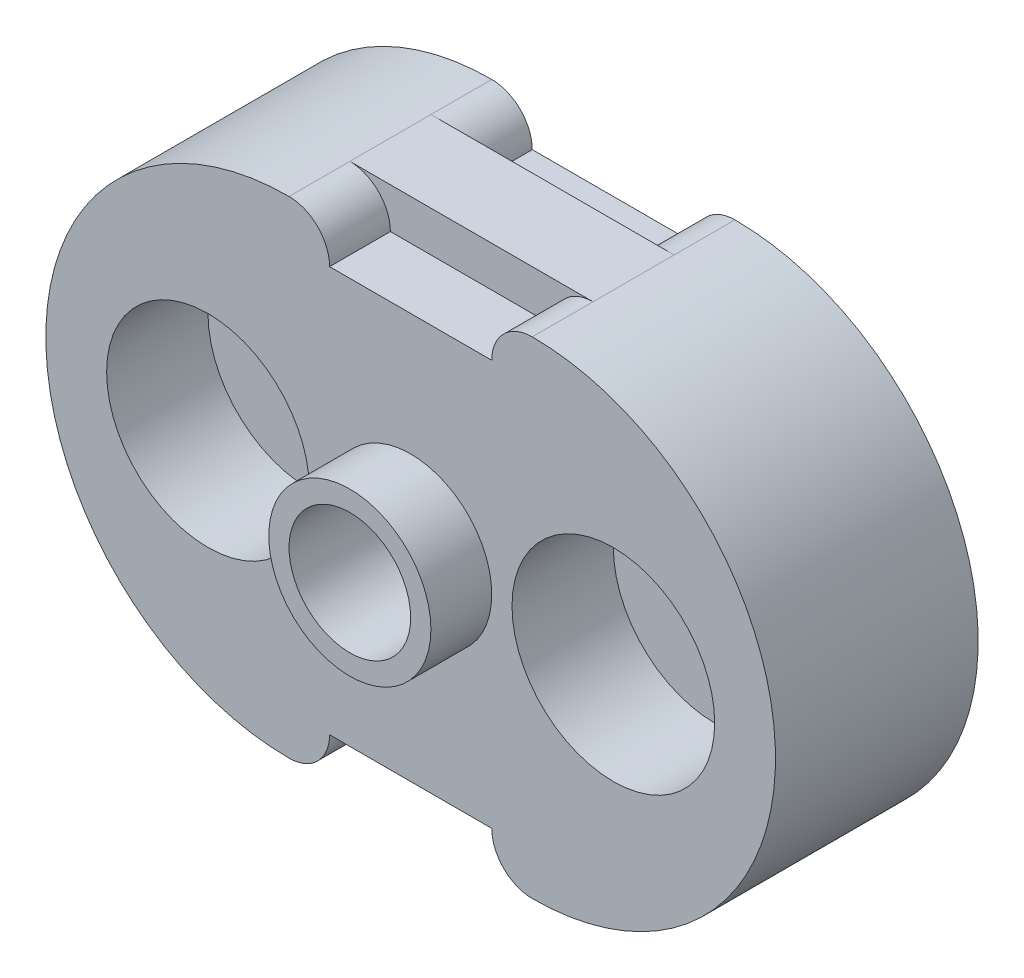
ISO-10303-21;
HEADER;
FILE_DESCRIPTION(('STEP AP214'),'2;1');
FILE_NAME('part.step','',(''),(''),'','','');
FILE_SCHEMA(('AUTOMOTIVE_DESIGN { 1 0 10303 214 1 1 1 1 }'));
ENDSEC;
DATA;
#1=APPLICATION_CONTEXT('core data for automotive mechanical design processes');
#2=APPLICATION_PROTOCOL_DEFINITION('international standard','automotive_design',2000,#1);
#3=PRODUCT_CONTEXT('',#1,'mechanical');
#4=PRODUCT('Part','Part','',(#3));
#5=PRODUCT_RELATED_PRODUCT_CATEGORY('part','',(#4));
#6=PRODUCT_DEFINITION_FORMATION('','',#4);
#7=PRODUCT_DEFINITION_CONTEXT('part definition',#1,'design');
#8=PRODUCT_DEFINITION('design','',#6,#7);
#9=PRODUCT_DEFINITION_SHAPE('','',#8);
#10=(LENGTH_UNIT() NAMED_UNIT(*) SI_UNIT(.MILLI.,.METRE.));
#11=(NAMED_UNIT(*) PLANE_ANGLE_UNIT() SI_UNIT($,.RADIAN.));
#12=(NAMED_UNIT(*) SI_UNIT($,.STERADIAN.) SOLID_ANGLE_UNIT());
#13=UNCERTAINTY_MEASURE_WITH_UNIT(LENGTH_MEASURE(1.E-05),#10,'distance_accuracy_value','');
#14=(GEOMETRIC_REPRESENTATION_CONTEXT(3) GLOBAL_UNCERTAINTY_ASSIGNED_CONTEXT((#13)) GLOBAL_UNIT_ASSIGNED_CONTEXT((#10,
#11,#12)) REPRESENTATION_CONTEXT('',''));
#15=CARTESIAN_POINT('',(0.,0.,0.));
#16=DIRECTION('',(0.,0.,1.));
#17=DIRECTION('',(1.,0.,0.));
#18=AXIS2_PLACEMENT_3D('',#15,#16,#17);
#19=CARTESIAN_POINT('',(5.,30.,0.));
#20=DIRECTION('',(0.,0.,-1.));
#21=DIRECTION('',(-1.,0.,0.));
#22=AXIS2_PLACEMENT_3D('',#19,#20,#21);
#23=PLANE('',#22);
#24=CARTESIAN_POINT('',(5.,30.,0.));
#25=DIRECTION('',(0.,0.,-1.));
#26=DIRECTION('',(-1.,0.,0.));
#27=AXIS2_PLACEMENT_3D('',#24,#25,#26);
#28=CIRCLE('',#27,20.);
#29=CARTESIAN_POINT('',(4.99999999999999,50.,0.));
#30=VERTEX_POINT('',#29);
#31=CARTESIAN_POINT('',(4.99999999999999,10.,0.));
#32=VERTEX_POINT('',#31);
#33=EDGE_CURVE('E173',#30,#32,#28,.T.);
#34=ORIENTED_EDGE('',*,*,#33,.T.);
#35=DIRECTION('',(-1.,0.,0.));
#36=VECTOR('',#35,1.);
#37=CARTESIAN_POINT('',(4.99999999999999,10.,0.));
#38=LINE('',#37,#36);
#39=CARTESIAN_POINT('',(-35.,10.,0.));
#40=VERTEX_POINT('',#39);
#41=EDGE_CURVE('E182',#32,#40,#38,.T.);
#42=ORIENTED_EDGE('',*,*,#41,.T.);
#43=CARTESIAN_POINT('',(-35.,30.,0.));
#44=DIRECTION('',(0.,0.,-1.));
#45=DIRECTION('',(-1.,0.,0.));
#46=AXIS2_PLACEMENT_3D('',#43,#44,#45);
#47=CIRCLE('',#46,20.);
#48=CARTESIAN_POINT('',(-35.,50.,0.));
#49=VERTEX_POINT('',#48);
#50=EDGE_CURVE('E187',#40,#49,#47,.T.);
#51=ORIENTED_EDGE('',*,*,#50,.T.);
#52=DIRECTION('',(1.,0.,0.));
#53=VECTOR('',#52,1.);
#54=CARTESIAN_POINT('',(4.99999999999999,50.,0.));
#55=LINE('',#54,#53);
#56=EDGE_CURVE('E179',#49,#30,#55,.T.);
#57=ORIENTED_EDGE('',*,*,#56,.T.);
#58=EDGE_LOOP('',(#34,#42,#51,#57));
#59=FACE_BOUND('',#58,.T.);
#60=CARTESIAN_POINT('',(10.,30.,0.));
#61=DIRECTION('',(0.,0.,-1.));
#62=DIRECTION('',(-1.,0.,0.));
#63=AXIS2_PLACEMENT_3D('',#60,#61,#62);
#64=CIRCLE('',#63,5.);
#65=CARTESIAN_POINT('',(5.00000000000001,30.,0.));
#66=VERTEX_POINT('',#65);
#67=EDGE_CURVE('E795',#66,#66,#64,.T.);
#68=ORIENTED_EDGE('',*,*,#67,.F.);
#69=EDGE_LOOP('',(#68));
#70=FACE_BOUND('',#69,.T.);
#71=CARTESIAN_POINT('',(-40.,30.,0.));
#72=DIRECTION('',(0.,0.,-1.));
#73=DIRECTION('',(-1.,0.,0.));
#74=AXIS2_PLACEMENT_3D('',#71,#72,#73);
#75=CIRCLE('',#74,5.);
#76=CARTESIAN_POINT('',(-45.,30.,0.));
#77=VERTEX_POINT('',#76);
#78=EDGE_CURVE('E789',#77,#77,#75,.T.);
#79=ORIENTED_EDGE('',*,*,#78,.F.);
#80=EDGE_LOOP('',(#79));
#81=FACE_BOUND('',#80,.T.);
#82=CARTESIAN_POINT('',(-15.,30.,0.));
#83=DIRECTION('',(0.,0.,-1.));
#84=DIRECTION('',(-1.,0.,0.));
#85=AXIS2_PLACEMENT_3D('',#82,#83,#84);
#86=CIRCLE('',#85,15.);
#87=CARTESIAN_POINT('',(-30.,30.,0.));
#88=VERTEX_POINT('',#87);
#89=EDGE_CURVE('E772',#88,#88,#86,.T.);
#90=ORIENTED_EDGE('',*,*,#89,.F.);
#91=EDGE_LOOP('',(#90));
#92=FACE_BOUND('',#91,.T.);
#93=ADVANCED_FACE('F33',(#59,#70,#81,#92),#23,.T.);
#94=CARTESIAN_POINT('',(-30.,55.,17.5));
#95=DIRECTION('',(0.,0.,1.));
#96=DIRECTION('',(1.,0.,0.));
#97=AXIS2_PLACEMENT_3D('',#94,#95,#96);
#98=PLANE('',#97);
#99=CARTESIAN_POINT('',(-30.,55.,17.5));
#100=DIRECTION('',(0.,0.,1.));
#101=DIRECTION('',(1.,0.,0.));
#102=AXIS2_PLACEMENT_3D('',#99,#100,#101);
#103=CIRCLE('',#102,5.00000000000001);
#104=CARTESIAN_POINT('',(-25.,55.,17.5));
#105=VERTEX_POINT('',#104);
#106=CARTESIAN_POINT('',(-30.,60.,17.5));
#107=VERTEX_POINT('',#106);
#108=EDGE_CURVE('E270',#105,#107,#103,.T.);
#109=ORIENTED_EDGE('',*,*,#108,.T.);
#110=CARTESIAN_POINT('',(-30.,30.,17.5));
#111=DIRECTION('',(0.,0.,1.));
#112=DIRECTION('',(1.,0.,0.));
#113=AXIS2_PLACEMENT_3D('',#110,#111,#112);
#114=CIRCLE('',#113,30.);
#115=CARTESIAN_POINT('',(-30.,0.,17.5));
#116=VERTEX_POINT('',#115);
#117=EDGE_CURVE('E273',#107,#116,#114,.T.);
#118=ORIENTED_EDGE('',*,*,#117,.T.);
#119=CARTESIAN_POINT('',(-30.,5.,17.5));
#120=DIRECTION('',(0.,0.,1.));
#121=DIRECTION('',(-1.,0.,0.));
#122=AXIS2_PLACEMENT_3D('',#119,#120,#121);
#123=CIRCLE('',#122,5.);
#124=CARTESIAN_POINT('',(-25.,5.,17.5));
#125=VERTEX_POINT('',#124);
#126=EDGE_CURVE('E276',#116,#125,#123,.T.);
#127=ORIENTED_EDGE('',*,*,#126,.T.);
#128=DIRECTION('',(1.,0.,0.));
#129=VECTOR('',#128,1.);
#130=CARTESIAN_POINT('',(-25.,5.,17.5));
#131=LINE('',#130,#129);
#132=CARTESIAN_POINT('',(-5.,5.,17.5));
#133=VERTEX_POINT('',#132);
#134=EDGE_CURVE('E278',#125,#133,#131,.T.);
#135=ORIENTED_EDGE('',*,*,#134,.T.);
#136=CARTESIAN_POINT('',(0.,5.,17.5));
#137=DIRECTION('',(0.,0.,1.));
#138=DIRECTION('',(1.,0.,0.));
#139=AXIS2_PLACEMENT_3D('',#136,#137,#138);
#140=CIRCLE('',#139,5.);
#141=CARTESIAN_POINT('',(0.,0.,17.5));
#142=VERTEX_POINT('',#141);
#143=EDGE_CURVE('E280',#133,#142,#140,.T.);
#144=ORIENTED_EDGE('',*,*,#143,.T.);
#145=CARTESIAN_POINT('',(0.,30.,17.5));
#146=DIRECTION('',(0.,0.,1.));
#147=DIRECTION('',(-1.,0.,0.));
#148=AXIS2_PLACEMENT_3D('',#145,#146,#147);
#149=CIRCLE('',#148,30.);
#150=CARTESIAN_POINT('',(0.,60.,17.5));
#151=VERTEX_POINT('',#150);
#152=EDGE_CURVE('E282',#142,#151,#149,.T.);
#153=ORIENTED_EDGE('',*,*,#152,.T.);
#154=CARTESIAN_POINT('',(0.,55.,17.5));
#155=DIRECTION('',(0.,0.,1.));
#156=DIRECTION('',(-1.,0.,0.));
#157=AXIS2_PLACEMENT_3D('',#154,#155,#156);
#158=CIRCLE('',#157,5.);
#159=CARTESIAN_POINT('',(-5.,55.,17.5));
#160=VERTEX_POINT('',#159);
#161=EDGE_CURVE('E284',#151,#160,#158,.T.);
#162=ORIENTED_EDGE('',*,*,#161,.T.);
#163=DIRECTION('',(-1.,0.,0.));
#164=VECTOR('',#163,1.);
#165=CARTESIAN_POINT('',(-25.,55.,17.5));
#166=LINE('',#165,#164);
#167=EDGE_CURVE('E286',#160,#105,#166,.T.);
#168=ORIENTED_EDGE('',*,*,#167,.T.);
#169=EDGE_LOOP('',(#109,#118,#127,#135,#144,#153,#162,#168));
#170=FACE_BOUND('',#169,.T.);
#171=CARTESIAN_POINT('',(10.,30.,17.5));
#172=DIRECTION('',(0.,0.,1.));
#173=DIRECTION('',(1.,0.,0.));
#174=AXIS2_PLACEMENT_3D('',#171,#172,#173);
#175=CIRCLE('',#174,12.5);
#176=CARTESIAN_POINT('',(22.5,30.,17.5));
#177=VERTEX_POINT('',#176);
#178=EDGE_CURVE('E197',#177,#177,#175,.T.);
#179=ORIENTED_EDGE('',*,*,#178,.F.);
#180=EDGE_LOOP('',(#179));
#181=FACE_BOUND('',#180,.T.);
#182=CARTESIAN_POINT('',(-40.,30.,17.5));
#183=DIRECTION('',(0.,0.,1.));
#184=DIRECTION('',(1.,0.,0.));
#185=AXIS2_PLACEMENT_3D('',#182,#183,#184);
#186=CIRCLE('',#185,12.5);
#187=CARTESIAN_POINT('',(-27.5,30.,17.5));
#188=VERTEX_POINT('',#187);
#189=EDGE_CURVE('E798',#188,#188,#186,.T.);
#190=ORIENTED_EDGE('',*,*,#189,.F.);
#191=EDGE_LOOP('',(#190));
#192=FACE_BOUND('',#191,.T.);
#193=CARTESIAN_POINT('',(-15.,30.,17.5));
#194=DIRECTION('',(0.,0.,1.));
#195=DIRECTION('',(1.,0.,0.));
#196=AXIS2_PLACEMENT_3D('',#193,#194,#195);
#197=CIRCLE('',#196,10.);
#198=CARTESIAN_POINT('',(-4.99999999999999,30.,17.5));
#199=VERTEX_POINT('',#198);
#200=EDGE_CURVE('E775',#199,#199,#197,.T.);
#201=ORIENTED_EDGE('',*,*,#200,.F.);
#202=EDGE_LOOP('',(#201));
#203=FACE_BOUND('',#202,.T.);
#204=ADVANCED_FACE('F388',(#170,#181,#192,#203),#98,.T.);
#205=CARTESIAN_POINT('',(-30.,30.,0.));
#206=DIRECTION('',(0.,0.,1.));
#207=DIRECTION('',(1.,0.,0.));
#208=AXIS2_PLACEMENT_3D('',#205,#206,#207);
#209=PLANE('',#208);
#210=CARTESIAN_POINT('',(0.,55.,0.));
#211=DIRECTION('',(0.,0.,-1.));
#212=DIRECTION('',(-1.,0.,0.));
#213=AXIS2_PLACEMENT_3D('',#210,#211,#212);
#214=CIRCLE('',#213,5.);
#215=CARTESIAN_POINT('',(-5.,55.,0.));
#216=VERTEX_POINT('',#215);
#217=CARTESIAN_POINT('',(0.,60.,0.));
#218=VERTEX_POINT('',#217);
#219=EDGE_CURVE('E56',#216,#218,#214,.T.);
#220=ORIENTED_EDGE('',*,*,#219,.F.);
#221=DIRECTION('',(1.,0.,0.));
#222=VECTOR('',#221,1.);
#223=CARTESIAN_POINT('',(-5.,55.,0.));
#224=LINE('',#223,#222);
#225=CARTESIAN_POINT('',(-25.,55.,0.));
#226=VERTEX_POINT('',#225);
#227=EDGE_CURVE('E217',#226,#216,#224,.T.);
#228=ORIENTED_EDGE('',*,*,#227,.F.);
#229=CARTESIAN_POINT('',(-30.,55.,0.));
#230=DIRECTION('',(0.,0.,-1.));
#231=DIRECTION('',(1.,0.,0.));
#232=AXIS2_PLACEMENT_3D('',#229,#230,#231);
#233=CIRCLE('',#232,5.00000000000001);
#234=CARTESIAN_POINT('',(-30.,60.,0.));
#235=VERTEX_POINT('',#234);
#236=EDGE_CURVE('E242',#235,#226,#233,.T.);
#237=ORIENTED_EDGE('',*,*,#236,.F.);
#238=DIRECTION('',(-1.,0.,0.));
#239=VECTOR('',#238,1.);
#240=CARTESIAN_POINT('',(-30.,60.,0.));
#241=LINE('',#240,#239);
#242=EDGE_CURVE('E332',#218,#235,#241,.T.);
#243=ORIENTED_EDGE('',*,*,#242,.F.);
#244=EDGE_LOOP('',(#220,#228,#237,#243));
#245=FACE_BOUND('',#244,.T.);
#246=ADVANCED_FACE('F371',(#245),#209,.F.);
#247=CARTESIAN_POINT('',(-30.,5.,0.));
#248=DIRECTION('',(0.,0.,-1.));
#249=DIRECTION('',(-1.,0.,0.));
#250=AXIS2_PLACEMENT_3D('',#247,#248,#249);
#251=CIRCLE('',#250,5.);
#252=CARTESIAN_POINT('',(-25.,5.,0.));
#253=VERTEX_POINT('',#252);
#254=CARTESIAN_POINT('',(-30.,0.,0.));
#255=VERTEX_POINT('',#254);
#256=EDGE_CURVE('E239',#253,#255,#251,.T.);
#257=ORIENTED_EDGE('',*,*,#256,.F.);
#258=DIRECTION('',(-1.,0.,0.));
#259=VECTOR('',#258,1.);
#260=CARTESIAN_POINT('',(-5.,5.,0.));
#261=LINE('',#260,#259);
#262=CARTESIAN_POINT('',(-5.,5.,0.));
#263=VERTEX_POINT('',#262);
#264=EDGE_CURVE('E236',#263,#253,#261,.T.);
#265=ORIENTED_EDGE('',*,*,#264,.F.);
#266=CARTESIAN_POINT('',(0.,5.,0.));
#267=DIRECTION('',(0.,0.,-1.));
#268=DIRECTION('',(1.,0.,0.));
#269=AXIS2_PLACEMENT_3D('',#266,#267,#268);
#270=CIRCLE('',#269,5.);
#271=CARTESIAN_POINT('',(0.,0.,0.));
#272=VERTEX_POINT('',#271);
#273=EDGE_CURVE('E233',#272,#263,#270,.T.);
#274=ORIENTED_EDGE('',*,*,#273,.F.);
#275=DIRECTION('',(1.,0.,0.));
#276=VECTOR('',#275,1.);
#277=CARTESIAN_POINT('',(-30.,0.,0.));
#278=LINE('',#277,#276);
#279=EDGE_CURVE('E328',#255,#272,#278,.T.);
#280=ORIENTED_EDGE('',*,*,#279,.F.);
#281=EDGE_LOOP('',(#257,#265,#274,#280));
#282=FACE_BOUND('',#281,.T.);
#283=ADVANCED_FACE('F411',(#282),#209,.F.);
#284=CARTESIAN_POINT('',(-30.,30.,10.));
#285=DIRECTION('',(0.,0.,1.));
#286=DIRECTION('',(1.,0.,0.));
#287=AXIS2_PLACEMENT_3D('',#284,#285,#286);
#288=PLANE('',#287);
#289=CARTESIAN_POINT('',(-30.,55.,10.));
#290=DIRECTION('',(0.,0.,1.));
#291=DIRECTION('',(1.,0.,0.));
#292=AXIS2_PLACEMENT_3D('',#289,#290,#291);
#293=CIRCLE('',#292,5.00000000000001);
#294=CARTESIAN_POINT('',(-25.,55.,10.));
#295=VERTEX_POINT('',#294);
#296=CARTESIAN_POINT('',(-30.,60.,10.));
#297=VERTEX_POINT('',#296);
#298=EDGE_CURVE('E269',#295,#297,#293,.T.);
#299=ORIENTED_EDGE('',*,*,#298,.F.);
#300=DIRECTION('',(-1.,0.,0.));
#301=VECTOR('',#300,1.);
#302=CARTESIAN_POINT('',(-25.,55.,10.));
#303=LINE('',#302,#301);
#304=CARTESIAN_POINT('',(-5.,55.,10.));
#305=VERTEX_POINT('',#304);
#306=EDGE_CURVE('E274',#305,#295,#303,.T.);
#307=ORIENTED_EDGE('',*,*,#306,.F.);
#308=CARTESIAN_POINT('',(0.,55.,10.));
#309=DIRECTION('',(0.,0.,1.));
#310=DIRECTION('',(-1.,0.,0.));
#311=AXIS2_PLACEMENT_3D('',#308,#309,#310);
#312=CIRCLE('',#311,5.);
#313=CARTESIAN_POINT('',(0.,60.,10.));
#314=VERTEX_POINT('',#313);
#315=EDGE_CURVE('E300',#314,#305,#312,.T.);
#316=ORIENTED_EDGE('',*,*,#315,.F.);
#317=DIRECTION('',(-1.,0.,0.));
#318=VECTOR('',#317,1.);
#319=CARTESIAN_POINT('',(-30.,60.,10.));
#320=LINE('',#319,#318);
#321=EDGE_CURVE('E331',#314,#297,#320,.T.);
#322=ORIENTED_EDGE('',*,*,#321,.T.);
#323=EDGE_LOOP('',(#299,#307,#316,#322));
#324=FACE_BOUND('',#323,.T.);
#325=ADVANCED_FACE('F655',(#324),#288,.T.);
#326=CARTESIAN_POINT('',(-30.,30.,10.));
#327=DIRECTION('',(0.,0.,-1.));
#328=DIRECTION('',(-1.,0.,0.));
#329=AXIS2_PLACEMENT_3D('',#326,#327,#328);
#330=CYLINDRICAL_SURFACE('',#329,30.);
#331=DIRECTION('',(0.,0.,-1.));
#332=VECTOR('',#331,1.);
#333=CARTESIAN_POINT('',(-30.,60.,10.));
#334=LINE('',#333,#332);
#335=EDGE_CURVE('E334',#297,#235,#334,.T.);
#336=ORIENTED_EDGE('',*,*,#335,.T.);
#337=DIRECTION('',(0.,0.,1.));
#338=VECTOR('',#337,1.);
#339=CARTESIAN_POINT('',(-30.,60.,-7.5));
#340=LINE('',#339,#338);
#341=CARTESIAN_POINT('',(-30.,60.,-7.5));
#342=VERTEX_POINT('',#341);
#343=EDGE_CURVE('E251',#342,#235,#340,.T.);
#344=ORIENTED_EDGE('',*,*,#343,.F.);
#345=CARTESIAN_POINT('',(-30.,30.,-7.5));
#346=DIRECTION('',(0.,0.,-1.));
#347=DIRECTION('',(-1.,0.,0.));
#348=AXIS2_PLACEMENT_3D('',#345,#346,#347);
#349=CIRCLE('',#348,30.);
#350=CARTESIAN_POINT('',(-30.,0.,-7.5));
#351=VERTEX_POINT('',#350);
#352=EDGE_CURVE('E225',#351,#342,#349,.T.);
#353=ORIENTED_EDGE('',*,*,#352,.F.);
#354=DIRECTION('',(0.,0.,1.));
#355=VECTOR('',#354,1.);
#356=CARTESIAN_POINT('',(-30.,0.,-7.5));
#357=LINE('',#356,#355);
#358=EDGE_CURVE('E254',#351,#255,#357,.T.);
#359=ORIENTED_EDGE('',*,*,#358,.T.);
#360=DIRECTION('',(0.,0.,-1.));
#361=VECTOR('',#360,1.);
#362=CARTESIAN_POINT('',(-30.,0.,10.));
#363=LINE('',#362,#361);
#364=CARTESIAN_POINT('',(-30.,0.,10.));
#365=VERTEX_POINT('',#364);
#366=EDGE_CURVE('E11',#365,#255,#363,.T.);
#367=ORIENTED_EDGE('',*,*,#366,.F.);
#368=DIRECTION('',(0.,0.,-1.));
#369=VECTOR('',#368,1.);
#370=CARTESIAN_POINT('',(-30.,0.,17.5));
#371=LINE('',#370,#369);
#372=EDGE_CURVE('E322',#116,#365,#371,.T.);
#373=ORIENTED_EDGE('',*,*,#372,.F.);
#374=ORIENTED_EDGE('',*,*,#117,.F.);
#375=DIRECTION('',(0.,0.,-1.));
#376=VECTOR('',#375,1.);
#377=CARTESIAN_POINT('',(-30.,60.,17.5));
#378=LINE('',#377,#376);
#379=EDGE_CURVE('E325',#107,#297,#378,.T.);
#380=ORIENTED_EDGE('',*,*,#379,.T.);
#381=EDGE_LOOP('',(#336,#344,#353,#359,#367,#373,#374,#380));
#382=FACE_BOUND('',#381,.T.);
#383=ADVANCED_FACE('F35',(#382),#330,.T.);
#384=CARTESIAN_POINT('',(-30.,0.,10.));
#385=DIRECTION('',(0.,1.,0.));
#386=DIRECTION('',(0.,0.,1.));
#387=AXIS2_PLACEMENT_3D('',#384,#385,#386);
#388=PLANE('',#387);
#389=ORIENTED_EDGE('',*,*,#279,.T.);
#390=DIRECTION('',(0.,0.,-1.));
#391=VECTOR('',#390,1.);
#392=CARTESIAN_POINT('',(0.,0.,10.));
#393=LINE('',#392,#391);
#394=CARTESIAN_POINT('',(0.,0.,10.));
#395=VERTEX_POINT('',#394);
#396=EDGE_CURVE('E41',#395,#272,#393,.T.);
#397=ORIENTED_EDGE('',*,*,#396,.F.);
#398=DIRECTION('',(1.,0.,0.));
#399=VECTOR('',#398,1.);
#400=CARTESIAN_POINT('',(-30.,0.,10.));
#401=LINE('',#400,#399);
#402=EDGE_CURVE('E329',#365,#395,#401,.T.);
#403=ORIENTED_EDGE('',*,*,#402,.F.);
#404=ORIENTED_EDGE('',*,*,#366,.T.);
#405=EDGE_LOOP('',(#389,#397,#403,#404));
#406=FACE_BOUND('',#405,.T.);
#407=ADVANCED_FACE('F405',(#406),#388,.F.);
#408=CARTESIAN_POINT('',(0.,30.,10.));
#409=DIRECTION('',(0.,0.,-1.));
#410=DIRECTION('',(-1.,0.,0.));
#411=AXIS2_PLACEMENT_3D('',#408,#409,#410);
#412=CYLINDRICAL_SURFACE('',#411,30.);
#413=ORIENTED_EDGE('',*,*,#396,.T.);
#414=DIRECTION('',(0.,0.,1.));
#415=VECTOR('',#414,1.);
#416=CARTESIAN_POINT('',(0.,0.,-7.5));
#417=LINE('',#416,#415);
#418=CARTESIAN_POINT('',(0.,0.,-7.5));
#419=VERTEX_POINT('',#418);
#420=EDGE_CURVE('E263',#419,#272,#417,.T.);
#421=ORIENTED_EDGE('',*,*,#420,.F.);
#422=CARTESIAN_POINT('',(0.,30.,-7.5));
#423=DIRECTION('',(0.,0.,-1.));
#424=DIRECTION('',(-1.,0.,0.));
#425=AXIS2_PLACEMENT_3D('',#422,#423,#424);
#426=CIRCLE('',#425,30.);
#427=CARTESIAN_POINT('',(0.,60.,-7.5));
#428=VERTEX_POINT('',#427);
#429=EDGE_CURVE('E216',#428,#419,#426,.T.);
#430=ORIENTED_EDGE('',*,*,#429,.F.);
#431=DIRECTION('',(0.,0.,1.));
#432=VECTOR('',#431,1.);
#433=CARTESIAN_POINT('',(0.,60.,-7.5));
#434=LINE('',#433,#432);
#435=EDGE_CURVE('E266',#428,#218,#434,.T.);
#436=ORIENTED_EDGE('',*,*,#435,.T.);
#437=DIRECTION('',(0.,0.,-1.));
#438=VECTOR('',#437,1.);
#439=CARTESIAN_POINT('',(0.,60.,10.));
#440=LINE('',#439,#438);
#441=EDGE_CURVE('E341',#314,#218,#440,.T.);
#442=ORIENTED_EDGE('',*,*,#441,.F.);
#443=DIRECTION('',(0.,0.,-1.));
#444=VECTOR('',#443,1.);
#445=CARTESIAN_POINT('',(0.,60.,17.5));
#446=LINE('',#445,#444);
#447=EDGE_CURVE('E310',#151,#314,#446,.T.);
#448=ORIENTED_EDGE('',*,*,#447,.F.);
#449=ORIENTED_EDGE('',*,*,#152,.F.);
#450=DIRECTION('',(0.,0.,-1.));
#451=VECTOR('',#450,1.);
#452=CARTESIAN_POINT('',(0.,0.,17.5));
#453=LINE('',#452,#451);
#454=EDGE_CURVE('E313',#142,#395,#453,.T.);
#455=ORIENTED_EDGE('',*,*,#454,.T.);
#456=EDGE_LOOP('',(#413,#421,#430,#436,#442,#448,#449,#455));
#457=FACE_BOUND('',#456,.T.);
#458=ADVANCED_FACE('F346',(#457),#412,.T.);
#459=CARTESIAN_POINT('',(-30.,60.,10.));
#460=DIRECTION('',(0.,-1.,0.));
#461=DIRECTION('',(0.,0.,-1.));
#462=AXIS2_PLACEMENT_3D('',#459,#460,#461);
#463=PLANE('',#462);
#464=ORIENTED_EDGE('',*,*,#242,.T.);
#465=ORIENTED_EDGE('',*,*,#335,.F.);
#466=ORIENTED_EDGE('',*,*,#321,.F.);
#467=ORIENTED_EDGE('',*,*,#441,.T.);
#468=EDGE_LOOP('',(#464,#465,#466,#467));
#469=FACE_BOUND('',#468,.T.);
#470=ADVANCED_FACE('F381',(#469),#463,.F.);
#471=CARTESIAN_POINT('',(0.,5.,10.));
#472=DIRECTION('',(0.,0.,1.));
#473=DIRECTION('',(1.,0.,0.));
#474=AXIS2_PLACEMENT_3D('',#471,#472,#473);
#475=CIRCLE('',#474,5.);
#476=CARTESIAN_POINT('',(-5.,5.,10.));
#477=VERTEX_POINT('',#476);
#478=EDGE_CURVE('E297',#477,#395,#475,.T.);
#479=ORIENTED_EDGE('',*,*,#478,.F.);
#480=DIRECTION('',(1.,0.,0.));
#481=VECTOR('',#480,1.);
#482=CARTESIAN_POINT('',(-25.,5.,10.));
#483=LINE('',#482,#481);
#484=CARTESIAN_POINT('',(-25.,5.,10.));
#485=VERTEX_POINT('',#484);
#486=EDGE_CURVE('E294',#485,#477,#483,.T.);
#487=ORIENTED_EDGE('',*,*,#486,.F.);
#488=CARTESIAN_POINT('',(-30.,5.,10.));
#489=DIRECTION('',(0.,0.,1.));
#490=DIRECTION('',(-1.,0.,0.));
#491=AXIS2_PLACEMENT_3D('',#488,#489,#490);
#492=CIRCLE('',#491,5.);
#493=EDGE_CURVE('E291',#365,#485,#492,.T.);
#494=ORIENTED_EDGE('',*,*,#493,.F.);
#495=ORIENTED_EDGE('',*,*,#402,.T.);
#496=EDGE_LOOP('',(#479,#487,#494,#495));
#497=FACE_BOUND('',#496,.T.);
#498=ADVANCED_FACE('F396',(#497),#288,.T.);
#499=CARTESIAN_POINT('',(-30.,55.,17.5));
#500=DIRECTION('',(0.,0.,-1.));
#501=DIRECTION('',(-1.,0.,0.));
#502=AXIS2_PLACEMENT_3D('',#499,#500,#501);
#503=CYLINDRICAL_SURFACE('',#502,5.00000000000001);
#504=ORIENTED_EDGE('',*,*,#298,.T.);
#505=ORIENTED_EDGE('',*,*,#379,.F.);
#506=ORIENTED_EDGE('',*,*,#108,.F.);
#507=DIRECTION('',(0.,0.,-1.));
#508=VECTOR('',#507,1.);
#509=CARTESIAN_POINT('',(-25.,55.,17.5));
#510=LINE('',#509,#508);
#511=EDGE_CURVE('E288',#105,#295,#510,.T.);
#512=ORIENTED_EDGE('',*,*,#511,.T.);
#513=EDGE_LOOP('',(#504,#505,#506,#512));
#514=FACE_BOUND('',#513,.T.);
#515=ADVANCED_FACE('F707',(#514),#503,.T.);
#516=CARTESIAN_POINT('',(-30.,5.,17.5));
#517=DIRECTION('',(0.,0.,-1.));
#518=DIRECTION('',(-1.,0.,0.));
#519=AXIS2_PLACEMENT_3D('',#516,#517,#518);
#520=CYLINDRICAL_SURFACE('',#519,5.);
#521=ORIENTED_EDGE('',*,*,#493,.T.);
#522=DIRECTION('',(0.,0.,-1.));
#523=VECTOR('',#522,1.);
#524=CARTESIAN_POINT('',(-25.,5.,17.5));
#525=LINE('',#524,#523);
#526=EDGE_CURVE('E319',#125,#485,#525,.T.);
#527=ORIENTED_EDGE('',*,*,#526,.F.);
#528=ORIENTED_EDGE('',*,*,#126,.F.);
#529=ORIENTED_EDGE('',*,*,#372,.T.);
#530=EDGE_LOOP('',(#521,#527,#528,#529));
#531=FACE_BOUND('',#530,.T.);
#532=ADVANCED_FACE('F402',(#531),#520,.T.);
#533=CARTESIAN_POINT('',(-25.,5.,17.5));
#534=DIRECTION('',(0.,1.,0.));
#535=DIRECTION('',(0.,0.,1.));
#536=AXIS2_PLACEMENT_3D('',#533,#534,#535);
#537=PLANE('',#536);
#538=ORIENTED_EDGE('',*,*,#486,.T.);
#539=DIRECTION('',(0.,0.,-1.));
#540=VECTOR('',#539,1.);
#541=CARTESIAN_POINT('',(-5.,5.,17.5));
#542=LINE('',#541,#540);
#543=EDGE_CURVE('E316',#133,#477,#542,.T.);
#544=ORIENTED_EDGE('',*,*,#543,.F.);
#545=ORIENTED_EDGE('',*,*,#134,.F.);
#546=ORIENTED_EDGE('',*,*,#526,.T.);
#547=EDGE_LOOP('',(#538,#544,#545,#546));
#548=FACE_BOUND('',#547,.T.);
#549=ADVANCED_FACE('F398',(#548),#537,.F.);
#550=CARTESIAN_POINT('',(0.,5.,17.5));
#551=DIRECTION('',(0.,0.,-1.));
#552=DIRECTION('',(-1.,0.,0.));
#553=AXIS2_PLACEMENT_3D('',#550,#551,#552);
#554=CYLINDRICAL_SURFACE('',#553,5.);
#555=ORIENTED_EDGE('',*,*,#478,.T.);
#556=ORIENTED_EDGE('',*,*,#454,.F.);
#557=ORIENTED_EDGE('',*,*,#143,.F.);
#558=ORIENTED_EDGE('',*,*,#543,.T.);
#559=EDGE_LOOP('',(#555,#556,#557,#558));
#560=FACE_BOUND('',#559,.T.);
#561=ADVANCED_FACE('F394',(#560),#554,.T.);
#562=CARTESIAN_POINT('',(0.,55.,17.5));
#563=DIRECTION('',(0.,0.,-1.));
#564=DIRECTION('',(-1.,0.,0.));
#565=AXIS2_PLACEMENT_3D('',#562,#563,#564);
#566=CYLINDRICAL_SURFACE('',#565,5.);
#567=ORIENTED_EDGE('',*,*,#315,.T.);
#568=DIRECTION('',(0.,0.,-1.));
#569=VECTOR('',#568,1.);
#570=CARTESIAN_POINT('',(-5.,55.,17.5));
#571=LINE('',#570,#569);
#572=EDGE_CURVE('E307',#160,#305,#571,.T.);
#573=ORIENTED_EDGE('',*,*,#572,.F.);
#574=ORIENTED_EDGE('',*,*,#161,.F.);
#575=ORIENTED_EDGE('',*,*,#447,.T.);
#576=EDGE_LOOP('',(#567,#573,#574,#575));
#577=FACE_BOUND('',#576,.T.);
#578=ADVANCED_FACE('F385',(#577),#566,.T.);
#579=CARTESIAN_POINT('',(-25.,55.,17.5));
#580=DIRECTION('',(0.,-1.,0.));
#581=DIRECTION('',(1.,0.,0.));
#582=AXIS2_PLACEMENT_3D('',#579,#580,#581);
#583=PLANE('',#582);
#584=ORIENTED_EDGE('',*,*,#306,.T.);
#585=ORIENTED_EDGE('',*,*,#511,.F.);
#586=ORIENTED_EDGE('',*,*,#167,.F.);
#587=ORIENTED_EDGE('',*,*,#572,.T.);
#588=EDGE_LOOP('',(#584,#585,#586,#587));
#589=FACE_BOUND('',#588,.T.);
#590=ADVANCED_FACE('F632',(#589),#583,.F.);
#591=CARTESIAN_POINT('',(0.,55.,-7.5));
#592=DIRECTION('',(0.,0.,1.));
#593=DIRECTION('',(1.,0.,0.));
#594=AXIS2_PLACEMENT_3D('',#591,#592,#593);
#595=CYLINDRICAL_SURFACE('',#594,5.);
#596=ORIENTED_EDGE('',*,*,#219,.T.);
#597=ORIENTED_EDGE('',*,*,#435,.F.);
#598=CARTESIAN_POINT('',(0.,55.,-7.5));
#599=DIRECTION('',(0.,0.,-1.));
#600=DIRECTION('',(-1.,0.,0.));
#601=AXIS2_PLACEMENT_3D('',#598,#599,#600);
#602=CIRCLE('',#601,5.);
#603=CARTESIAN_POINT('',(-5.,55.,-7.5));
#604=VERTEX_POINT('',#603);
#605=EDGE_CURVE('E213',#604,#428,#602,.T.);
#606=ORIENTED_EDGE('',*,*,#605,.F.);
#607=DIRECTION('',(0.,0.,1.));
#608=VECTOR('',#607,1.);
#609=CARTESIAN_POINT('',(-5.,55.,-7.5));
#610=LINE('',#609,#608);
#611=EDGE_CURVE('E231',#604,#216,#610,.T.);
#612=ORIENTED_EDGE('',*,*,#611,.T.);
#613=EDGE_LOOP('',(#596,#597,#606,#612));
#614=FACE_BOUND('',#613,.T.);
#615=ADVANCED_FACE('F365',(#614),#595,.T.);
#616=CARTESIAN_POINT('',(0.,5.,-7.5));
#617=DIRECTION('',(0.,0.,1.));
#618=DIRECTION('',(1.,0.,0.));
#619=AXIS2_PLACEMENT_3D('',#616,#617,#618);
#620=CYLINDRICAL_SURFACE('',#619,5.);
#621=ORIENTED_EDGE('',*,*,#273,.T.);
#622=DIRECTION('',(0.,0.,1.));
#623=VECTOR('',#622,1.);
#624=CARTESIAN_POINT('',(-5.,5.,-7.5));
#625=LINE('',#624,#623);
#626=CARTESIAN_POINT('',(-5.,5.,-7.5));
#627=VERTEX_POINT('',#626);
#628=EDGE_CURVE('E260',#627,#263,#625,.T.);
#629=ORIENTED_EDGE('',*,*,#628,.F.);
#630=CARTESIAN_POINT('',(0.,5.,-7.5));
#631=DIRECTION('',(0.,0.,-1.));
#632=DIRECTION('',(1.,0.,0.));
#633=AXIS2_PLACEMENT_3D('',#630,#631,#632);
#634=CIRCLE('',#633,5.);
#635=EDGE_CURVE('E219',#419,#627,#634,.T.);
#636=ORIENTED_EDGE('',*,*,#635,.F.);
#637=ORIENTED_EDGE('',*,*,#420,.T.);
#638=EDGE_LOOP('',(#621,#629,#636,#637));
#639=FACE_BOUND('',#638,.T.);
#640=ADVANCED_FACE('F353',(#639),#620,.T.);
#641=CARTESIAN_POINT('',(-5.,5.,-7.5));
#642=DIRECTION('',(0.,1.,0.));
#643=DIRECTION('',(0.,0.,1.));
#644=AXIS2_PLACEMENT_3D('',#641,#642,#643);
#645=PLANE('',#644);
#646=ORIENTED_EDGE('',*,*,#264,.T.);
#647=DIRECTION('',(0.,0.,1.));
#648=VECTOR('',#647,1.);
#649=CARTESIAN_POINT('',(-25.,5.,-7.5));
#650=LINE('',#649,#648);
#651=CARTESIAN_POINT('',(-25.,5.,-7.5));
#652=VERTEX_POINT('',#651);
#653=EDGE_CURVE('E257',#652,#253,#650,.T.);
#654=ORIENTED_EDGE('',*,*,#653,.F.);
#655=DIRECTION('',(-1.,0.,0.));
#656=VECTOR('',#655,1.);
#657=CARTESIAN_POINT('',(-5.,5.,-7.5));
#658=LINE('',#657,#656);
#659=EDGE_CURVE('E221',#627,#652,#658,.T.);
#660=ORIENTED_EDGE('',*,*,#659,.F.);
#661=ORIENTED_EDGE('',*,*,#628,.T.);
#662=EDGE_LOOP('',(#646,#654,#660,#661));
#663=FACE_BOUND('',#662,.T.);
#664=ADVANCED_FACE('F413',(#663),#645,.F.);
#665=CARTESIAN_POINT('',(-30.,5.,-7.5));
#666=DIRECTION('',(0.,0.,1.));
#667=DIRECTION('',(1.,0.,0.));
#668=AXIS2_PLACEMENT_3D('',#665,#666,#667);
#669=CYLINDRICAL_SURFACE('',#668,5.);
#670=ORIENTED_EDGE('',*,*,#256,.T.);
#671=ORIENTED_EDGE('',*,*,#358,.F.);
#672=CARTESIAN_POINT('',(-30.,5.,-7.5));
#673=DIRECTION('',(0.,0.,-1.));
#674=DIRECTION('',(-1.,0.,0.));
#675=AXIS2_PLACEMENT_3D('',#672,#673,#674);
#676=CIRCLE('',#675,5.);
#677=EDGE_CURVE('E223',#652,#351,#676,.T.);
#678=ORIENTED_EDGE('',*,*,#677,.F.);
#679=ORIENTED_EDGE('',*,*,#653,.T.);
#680=EDGE_LOOP('',(#670,#671,#678,#679));
#681=FACE_BOUND('',#680,.T.);
#682=ADVANCED_FACE('F409',(#681),#669,.T.);
#683=CARTESIAN_POINT('',(-30.,55.,-7.5));
#684=DIRECTION('',(0.,0.,1.));
#685=DIRECTION('',(1.,0.,0.));
#686=AXIS2_PLACEMENT_3D('',#683,#684,#685);
#687=CYLINDRICAL_SURFACE('',#686,5.00000000000001);
#688=ORIENTED_EDGE('',*,*,#236,.T.);
#689=DIRECTION('',(0.,0.,1.));
#690=VECTOR('',#689,1.);
#691=CARTESIAN_POINT('',(-25.,55.,-7.5));
#692=LINE('',#691,#690);
#693=CARTESIAN_POINT('',(-25.,55.,-7.5));
#694=VERTEX_POINT('',#693);
#695=EDGE_CURVE('E248',#694,#226,#692,.T.);
#696=ORIENTED_EDGE('',*,*,#695,.F.);
#697=CARTESIAN_POINT('',(-30.,55.,-7.5));
#698=DIRECTION('',(0.,0.,-1.));
#699=DIRECTION('',(1.,0.,0.));
#700=AXIS2_PLACEMENT_3D('',#697,#698,#699);
#701=CIRCLE('',#700,5.00000000000001);
#702=EDGE_CURVE('E227',#342,#694,#701,.T.);
#703=ORIENTED_EDGE('',*,*,#702,.F.);
#704=ORIENTED_EDGE('',*,*,#343,.T.);
#705=EDGE_LOOP('',(#688,#696,#703,#704));
#706=FACE_BOUND('',#705,.T.);
#707=ADVANCED_FACE('F373',(#706),#687,.T.);
#708=CARTESIAN_POINT('',(-5.,55.,-7.5));
#709=DIRECTION('',(0.,-1.,0.));
#710=DIRECTION('',(1.,0.,0.));
#711=AXIS2_PLACEMENT_3D('',#708,#709,#710);
#712=PLANE('',#711);
#713=ORIENTED_EDGE('',*,*,#227,.T.);
#714=ORIENTED_EDGE('',*,*,#611,.F.);
#715=DIRECTION('',(1.,0.,0.));
#716=VECTOR('',#715,1.);
#717=CARTESIAN_POINT('',(-5.,55.,-7.5));
#718=LINE('',#717,#716);
#719=EDGE_CURVE('E229',#694,#604,#718,.T.);
#720=ORIENTED_EDGE('',*,*,#719,.F.);
#721=ORIENTED_EDGE('',*,*,#695,.T.);
#722=EDGE_LOOP('',(#713,#714,#720,#721));
#723=FACE_BOUND('',#722,.T.);
#724=ADVANCED_FACE('F369',(#723),#712,.F.);
#725=CARTESIAN_POINT('',(0.,55.,-7.5));
#726=DIRECTION('',(0.,0.,-1.));
#727=DIRECTION('',(-1.,0.,0.));
#728=AXIS2_PLACEMENT_3D('',#725,#726,#727);
#729=PLANE('',#728);
#730=CARTESIAN_POINT('',(5.,30.,-7.5));
#731=DIRECTION('',(0.,0.,-1.));
#732=DIRECTION('',(-1.,0.,0.));
#733=AXIS2_PLACEMENT_3D('',#730,#731,#732);
#734=CIRCLE('',#733,20.);
#735=CARTESIAN_POINT('',(4.99999999999999,50.,-7.5));
#736=VERTEX_POINT('',#735);
#737=CARTESIAN_POINT('',(4.99999999999999,10.,-7.5));
#738=VERTEX_POINT('',#737);
#739=EDGE_CURVE('E48',#736,#738,#734,.T.);
#740=ORIENTED_EDGE('',*,*,#739,.F.);
#741=DIRECTION('',(1.,0.,0.));
#742=VECTOR('',#741,1.);
#743=CARTESIAN_POINT('',(4.99999999999999,50.,-7.5));
#744=LINE('',#743,#742);
#745=CARTESIAN_POINT('',(-35.,50.,-7.5));
#746=VERTEX_POINT('',#745);
#747=EDGE_CURVE('E191',#746,#736,#744,.T.);
#748=ORIENTED_EDGE('',*,*,#747,.F.);
#749=CARTESIAN_POINT('',(-35.,30.,-7.5));
#750=DIRECTION('',(0.,0.,-1.));
#751=DIRECTION('',(-1.,0.,0.));
#752=AXIS2_PLACEMENT_3D('',#749,#750,#751);
#753=CIRCLE('',#752,20.);
#754=CARTESIAN_POINT('',(-35.,10.,-7.5));
#755=VERTEX_POINT('',#754);
#756=EDGE_CURVE('E194',#755,#746,#753,.T.);
#757=ORIENTED_EDGE('',*,*,#756,.F.);
#758=DIRECTION('',(-1.,0.,0.));
#759=VECTOR('',#758,1.);
#760=CARTESIAN_POINT('',(4.99999999999999,10.,-7.5));
#761=LINE('',#760,#759);
#762=EDGE_CURVE('E203',#738,#755,#761,.T.);
#763=ORIENTED_EDGE('',*,*,#762,.F.);
#764=EDGE_LOOP('',(#740,#748,#757,#763));
#765=FACE_BOUND('',#764,.T.);
#766=ORIENTED_EDGE('',*,*,#605,.T.);
#767=ORIENTED_EDGE('',*,*,#429,.T.);
#768=ORIENTED_EDGE('',*,*,#635,.T.);
#769=ORIENTED_EDGE('',*,*,#659,.T.);
#770=ORIENTED_EDGE('',*,*,#677,.T.);
#771=ORIENTED_EDGE('',*,*,#352,.T.);
#772=ORIENTED_EDGE('',*,*,#702,.T.);
#773=ORIENTED_EDGE('',*,*,#719,.T.);
#774=EDGE_LOOP('',(#766,#767,#768,#769,#770,#771,#772,#773));
#775=FACE_BOUND('',#774,.T.);
#776=ADVANCED_FACE('F357',(#765,#775),#729,.T.);
#777=CARTESIAN_POINT('',(5.,30.,0.));
#778=DIRECTION('',(0.,0.,-1.));
#779=DIRECTION('',(-1.,0.,0.));
#780=AXIS2_PLACEMENT_3D('',#777,#778,#779);
#781=CYLINDRICAL_SURFACE('',#780,20.);
#782=ORIENTED_EDGE('',*,*,#739,.T.);
#783=DIRECTION('',(0.,0.,-1.));
#784=VECTOR('',#783,1.);
#785=CARTESIAN_POINT('',(4.99999999999999,10.,0.));
#786=LINE('',#785,#784);
#787=EDGE_CURVE('E169',#32,#738,#786,.T.);
#788=ORIENTED_EDGE('',*,*,#787,.F.);
#789=ORIENTED_EDGE('',*,*,#33,.F.);
#790=DIRECTION('',(0.,0.,-1.));
#791=VECTOR('',#790,1.);
#792=CARTESIAN_POINT('',(4.99999999999999,50.,0.));
#793=LINE('',#792,#791);
#794=EDGE_CURVE('E208',#30,#736,#793,.T.);
#795=ORIENTED_EDGE('',*,*,#794,.T.);
#796=EDGE_LOOP('',(#782,#788,#789,#795));
#797=FACE_BOUND('',#796,.T.);
#798=ADVANCED_FACE('F171',(#797),#781,.F.);
#799=CARTESIAN_POINT('',(4.99999999999999,50.,0.));
#800=DIRECTION('',(0.,1.,0.));
#801=DIRECTION('',(0.,0.,1.));
#802=AXIS2_PLACEMENT_3D('',#799,#800,#801);
#803=PLANE('',#802);
#804=ORIENTED_EDGE('',*,*,#747,.T.);
#805=ORIENTED_EDGE('',*,*,#794,.F.);
#806=ORIENTED_EDGE('',*,*,#56,.F.);
#807=DIRECTION('',(0.,0.,-1.));
#808=VECTOR('',#807,1.);
#809=CARTESIAN_POINT('',(-35.,50.,0.));
#810=LINE('',#809,#808);
#811=EDGE_CURVE('E210',#49,#746,#810,.T.);
#812=ORIENTED_EDGE('',*,*,#811,.T.);
#813=EDGE_LOOP('',(#804,#805,#806,#812));
#814=FACE_BOUND('',#813,.T.);
#815=ADVANCED_FACE('F432',(#814),#803,.F.);
#816=CARTESIAN_POINT('',(-35.,30.,0.));
#817=DIRECTION('',(0.,0.,-1.));
#818=DIRECTION('',(-1.,0.,0.));
#819=AXIS2_PLACEMENT_3D('',#816,#817,#818);
#820=CYLINDRICAL_SURFACE('',#819,20.);
#821=ORIENTED_EDGE('',*,*,#756,.T.);
#822=ORIENTED_EDGE('',*,*,#811,.F.);
#823=ORIENTED_EDGE('',*,*,#50,.F.);
#824=DIRECTION('',(0.,0.,-1.));
#825=VECTOR('',#824,1.);
#826=CARTESIAN_POINT('',(-35.,10.,0.));
#827=LINE('',#826,#825);
#828=EDGE_CURVE('E178',#40,#755,#827,.T.);
#829=ORIENTED_EDGE('',*,*,#828,.T.);
#830=EDGE_LOOP('',(#821,#822,#823,#829));
#831=FACE_BOUND('',#830,.T.);
#832=ADVANCED_FACE('F435',(#831),#820,.F.);
#833=CARTESIAN_POINT('',(4.99999999999999,10.,0.));
#834=DIRECTION('',(0.,-1.,0.));
#835=DIRECTION('',(0.,0.,-1.));
#836=AXIS2_PLACEMENT_3D('',#833,#834,#835);
#837=PLANE('',#836);
#838=ORIENTED_EDGE('',*,*,#762,.T.);
#839=ORIENTED_EDGE('',*,*,#828,.F.);
#840=ORIENTED_EDGE('',*,*,#41,.F.);
#841=ORIENTED_EDGE('',*,*,#787,.T.);
#842=EDGE_LOOP('',(#838,#839,#840,#841));
#843=FACE_BOUND('',#842,.T.);
#844=ADVANCED_FACE('F183',(#843),#837,.F.);
#845=CARTESIAN_POINT('',(10.,30.,5.));
#846=DIRECTION('',(0.,0.,1.));
#847=DIRECTION('',(1.,0.,0.));
#848=AXIS2_PLACEMENT_3D('',#845,#846,#847);
#849=CYLINDRICAL_SURFACE('',#848,12.5);
#850=CARTESIAN_POINT('',(10.,30.,5.));
#851=DIRECTION('',(0.,0.,1.));
#852=DIRECTION('',(1.,0.,0.));
#853=AXIS2_PLACEMENT_3D('',#850,#851,#852);
#854=CIRCLE('',#853,12.5);
#855=CARTESIAN_POINT('',(22.5,30.,5.));
#856=VERTEX_POINT('',#855);
#857=EDGE_CURVE('E204',#856,#856,#854,.T.);
#858=ORIENTED_EDGE('',*,*,#857,.F.);
#859=EDGE_LOOP('',(#858));
#860=FACE_BOUND('',#859,.T.);
#861=ORIENTED_EDGE('',*,*,#178,.T.);
#862=EDGE_LOOP('',(#861));
#863=FACE_BOUND('',#862,.T.);
#864=ADVANCED_FACE('F430',(#860,#863),#849,.F.);
#865=CARTESIAN_POINT('',(10.,30.,5.));
#866=DIRECTION('',(0.,0.,1.));
#867=DIRECTION('',(1.,0.,0.));
#868=AXIS2_PLACEMENT_3D('',#865,#866,#867);
#869=PLANE('',#868);
#870=CARTESIAN_POINT('',(10.,30.,5.));
#871=DIRECTION('',(0.,0.,1.));
#872=DIRECTION('',(1.,0.,0.));
#873=AXIS2_PLACEMENT_3D('',#870,#871,#872);
#874=CIRCLE('',#873,5.);
#875=CARTESIAN_POINT('',(15.,30.,5.));
#876=VERTEX_POINT('',#875);
#877=EDGE_CURVE('E792',#876,#876,#874,.T.);
#878=ORIENTED_EDGE('',*,*,#877,.F.);
#879=EDGE_LOOP('',(#878));
#880=FACE_BOUND('',#879,.T.);
#881=ORIENTED_EDGE('',*,*,#857,.T.);
#882=EDGE_LOOP('',(#881));
#883=FACE_BOUND('',#882,.T.);
#884=ADVANCED_FACE('F484',(#880,#883),#869,.T.);
#885=CARTESIAN_POINT('',(-40.,30.,5.));
#886=DIRECTION('',(0.,0.,1.));
#887=DIRECTION('',(1.,0.,0.));
#888=AXIS2_PLACEMENT_3D('',#885,#886,#887);
#889=CYLINDRICAL_SURFACE('',#888,12.5);
#890=CARTESIAN_POINT('',(-40.,30.,5.));
#891=DIRECTION('',(0.,0.,1.));
#892=DIRECTION('',(1.,0.,0.));
#893=AXIS2_PLACEMENT_3D('',#890,#891,#892);
#894=CIRCLE('',#893,12.5);
#895=CARTESIAN_POINT('',(-27.5,30.,5.));
#896=VERTEX_POINT('',#895);
#897=EDGE_CURVE('E799',#896,#896,#894,.T.);
#898=ORIENTED_EDGE('',*,*,#897,.F.);
#899=EDGE_LOOP('',(#898));
#900=FACE_BOUND('',#899,.T.);
#901=ORIENTED_EDGE('',*,*,#189,.T.);
#902=EDGE_LOOP('',(#901));
#903=FACE_BOUND('',#902,.T.);
#904=ADVANCED_FACE('F492',(#900,#903),#889,.F.);
#905=CARTESIAN_POINT('',(-40.,30.,5.));
#906=DIRECTION('',(0.,0.,1.));
#907=DIRECTION('',(1.,0.,0.));
#908=AXIS2_PLACEMENT_3D('',#905,#906,#907);
#909=PLANE('',#908);
#910=CARTESIAN_POINT('',(-40.,30.,5.));
#911=DIRECTION('',(0.,0.,1.));
#912=DIRECTION('',(1.,0.,0.));
#913=AXIS2_PLACEMENT_3D('',#910,#911,#912);
#914=CIRCLE('',#913,5.);
#915=CARTESIAN_POINT('',(-35.,30.,5.));
#916=VERTEX_POINT('',#915);
#917=EDGE_CURVE('E784',#916,#916,#914,.T.);
#918=ORIENTED_EDGE('',*,*,#917,.F.);
#919=EDGE_LOOP('',(#918));
#920=FACE_BOUND('',#919,.T.);
#921=ORIENTED_EDGE('',*,*,#897,.T.);
#922=EDGE_LOOP('',(#921));
#923=FACE_BOUND('',#922,.T.);
#924=ADVANCED_FACE('F499',(#920,#923),#909,.T.);
#925=CARTESIAN_POINT('',(10.,30.,-12.5));
#926=DIRECTION('',(0.,0.,1.));
#927=DIRECTION('',(1.,0.,0.));
#928=AXIS2_PLACEMENT_3D('',#925,#926,#927);
#929=CYLINDRICAL_SURFACE('',#928,5.);
#930=ORIENTED_EDGE('',*,*,#67,.T.);
#931=EDGE_LOOP('',(#930));
#932=FACE_BOUND('',#931,.T.);
#933=ORIENTED_EDGE('',*,*,#877,.T.);
#934=EDGE_LOOP('',(#933));
#935=FACE_BOUND('',#934,.T.);
#936=ADVANCED_FACE('F506',(#932,#935),#929,.F.);
#937=CARTESIAN_POINT('',(-40.,30.,-12.5));
#938=DIRECTION('',(0.,0.,1.));
#939=DIRECTION('',(1.,0.,0.));
#940=AXIS2_PLACEMENT_3D('',#937,#938,#939);
#941=CYLINDRICAL_SURFACE('',#940,5.);
#942=ORIENTED_EDGE('',*,*,#78,.T.);
#943=EDGE_LOOP('',(#942));
#944=FACE_BOUND('',#943,.T.);
#945=ORIENTED_EDGE('',*,*,#917,.T.);
#946=EDGE_LOOP('',(#945));
#947=FACE_BOUND('',#946,.T.);
#948=ADVANCED_FACE('F514',(#944,#947),#941,.F.);
#949=CARTESIAN_POINT('',(-15.,30.,25.));
#950=DIRECTION('',(0.,0.,-1.));
#951=DIRECTION('',(-1.,0.,0.));
#952=AXIS2_PLACEMENT_3D('',#949,#950,#951);
#953=CYLINDRICAL_SURFACE('',#952,10.);
#954=CARTESIAN_POINT('',(-15.,30.,25.));
#955=DIRECTION('',(0.,0.,1.));
#956=DIRECTION('',(1.,0.,0.));
#957=AXIS2_PLACEMENT_3D('',#954,#955,#956);
#958=CIRCLE('',#957,10.);
#959=CARTESIAN_POINT('',(-4.99999999999999,30.,25.));
#960=VERTEX_POINT('',#959);
#961=EDGE_CURVE('E781',#960,#960,#958,.T.);
#962=ORIENTED_EDGE('',*,*,#961,.F.);
#963=EDGE_LOOP('',(#962));
#964=FACE_BOUND('',#963,.T.);
#965=ORIENTED_EDGE('',*,*,#200,.T.);
#966=EDGE_LOOP('',(#965));
#967=FACE_BOUND('',#966,.T.);
#968=ADVANCED_FACE('F522',(#964,#967),#953,.T.);
#969=CARTESIAN_POINT('',(-15.,30.,25.));
#970=DIRECTION('',(0.,0.,1.));
#971=DIRECTION('',(1.,0.,0.));
#972=AXIS2_PLACEMENT_3D('',#969,#970,#971);
#973=PLANE('',#972);
#974=CARTESIAN_POINT('',(-15.,30.,25.));
#975=DIRECTION('',(0.,0.,1.));
#976=DIRECTION('',(1.,0.,0.));
#977=AXIS2_PLACEMENT_3D('',#974,#975,#976);
#978=CIRCLE('',#977,7.5);
#979=CARTESIAN_POINT('',(-7.5,30.,25.));
#980=VERTEX_POINT('',#979);
#981=EDGE_CURVE('E771',#980,#980,#978,.T.);
#982=ORIENTED_EDGE('',*,*,#981,.F.);
#983=EDGE_LOOP('',(#982));
#984=FACE_BOUND('',#983,.T.);
#985=ORIENTED_EDGE('',*,*,#961,.T.);
#986=EDGE_LOOP('',(#985));
#987=FACE_BOUND('',#986,.T.);
#988=ADVANCED_FACE('F531',(#984,#987),#973,.T.);
#989=CARTESIAN_POINT('',(-15.,30.,0.));
#990=DIRECTION('',(0.,0.,1.));
#991=DIRECTION('',(1.,0.,0.));
#992=AXIS2_PLACEMENT_3D('',#989,#990,#991);
#993=CYLINDRICAL_SURFACE('',#992,7.5);
#994=CARTESIAN_POINT('',(-15.,30.,-15.));
#995=DIRECTION('',(0.,0.,-1.));
#996=DIRECTION('',(-1.,0.,0.));
#997=AXIS2_PLACEMENT_3D('',#994,#995,#996);
#998=CIRCLE('',#997,7.5);
#999=CARTESIAN_POINT('',(-22.5,30.,-15.));
#1000=VERTEX_POINT('',#999);
#1001=EDGE_CURVE('E767',#1000,#1000,#998,.T.);
#1002=ORIENTED_EDGE('',*,*,#1001,.T.);
#1003=EDGE_LOOP('',(#1002));
#1004=FACE_BOUND('',#1003,.T.);
#1005=ORIENTED_EDGE('',*,*,#981,.T.);
#1006=EDGE_LOOP('',(#1005));
#1007=FACE_BOUND('',#1006,.T.);
#1008=ADVANCED_FACE('F539',(#1004,#1007),#993,.F.);
#1009=CARTESIAN_POINT('',(-15.,30.,-15.));
#1010=DIRECTION('',(0.,0.,1.));
#1011=DIRECTION('',(1.,0.,0.));
#1012=AXIS2_PLACEMENT_3D('',#1009,#1010,#1011);
#1013=CYLINDRICAL_SURFACE('',#1012,15.);
#1014=CARTESIAN_POINT('',(-15.,30.,-15.));
#1015=DIRECTION('',(0.,0.,-1.));
#1016=DIRECTION('',(-1.,0.,0.));
#1017=AXIS2_PLACEMENT_3D('',#1014,#1015,#1016);
#1018=CIRCLE('',#1017,15.);
#1019=CARTESIAN_POINT('',(-30.,30.,-15.));
#1020=VERTEX_POINT('',#1019);
#1021=EDGE_CURVE('E770',#1020,#1020,#1018,.T.);
#1022=ORIENTED_EDGE('',*,*,#1021,.F.);
#1023=EDGE_LOOP('',(#1022));
#1024=FACE_BOUND('',#1023,.T.);
#1025=ORIENTED_EDGE('',*,*,#89,.T.);
#1026=EDGE_LOOP('',(#1025));
#1027=FACE_BOUND('',#1026,.T.);
#1028=ADVANCED_FACE('F547',(#1024,#1027),#1013,.T.);
#1029=CARTESIAN_POINT('',(-15.,30.,-15.));
#1030=DIRECTION('',(0.,0.,-1.));
#1031=DIRECTION('',(-1.,0.,0.));
#1032=AXIS2_PLACEMENT_3D('',#1029,#1030,#1031);
#1033=PLANE('',#1032);
#1034=ORIENTED_EDGE('',*,*,#1001,.F.);
#1035=EDGE_LOOP('',(#1034));
#1036=FACE_BOUND('',#1035,.T.);
#1037=ORIENTED_EDGE('',*,*,#1021,.T.);
#1038=EDGE_LOOP('',(#1037));
#1039=FACE_BOUND('',#1038,.T.);
#1040=ADVANCED_FACE('F556',(#1036,#1039),#1033,.T.);
#1041=CLOSED_SHELL('',(#93,#204,#246,#283,#325,#383,#407,#458,#470,#498,#515,#532,#549,#561,
#578,#590,#615,#640,#664,#682,#707,#724,#776,#798,#815,#832,#844,#864,#884,#904,#924,#936,#948,
#968,#988,#1008,#1028,#1040));
#1042=MANIFOLD_SOLID_BREP('B2',#1041);
#1043=ADVANCED_BREP_SHAPE_REPRESENTATION('',(#18,#1042),#14);
#1044=SHAPE_DEFINITION_REPRESENTATION(#9,#1043);
ENDSEC;
END-ISO-10303-21;
